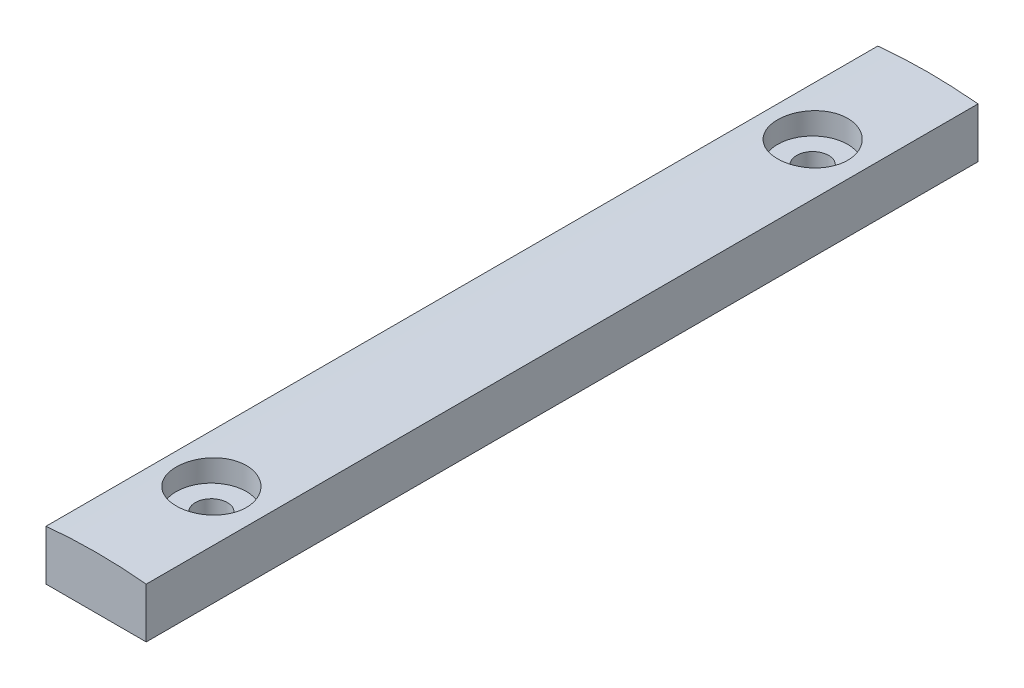
ISO-10303-21;
HEADER;
FILE_DESCRIPTION(('STEP AP214'),'2;1');
FILE_NAME('part.step','',(''),(''),'','','');
FILE_SCHEMA(('AUTOMOTIVE_DESIGN { 1 0 10303 214 1 1 1 1 }'));
ENDSEC;
DATA;
#1=APPLICATION_CONTEXT('core data for automotive mechanical design processes');
#2=APPLICATION_PROTOCOL_DEFINITION('international standard','automotive_design',2000,#1);
#3=PRODUCT_CONTEXT('',#1,'mechanical');
#4=PRODUCT('Part','Part','',(#3));
#5=PRODUCT_RELATED_PRODUCT_CATEGORY('part','',(#4));
#6=PRODUCT_DEFINITION_FORMATION('','',#4);
#7=PRODUCT_DEFINITION_CONTEXT('part definition',#1,'design');
#8=PRODUCT_DEFINITION('design','',#6,#7);
#9=PRODUCT_DEFINITION_SHAPE('','',#8);
#10=(LENGTH_UNIT() NAMED_UNIT(*) SI_UNIT(.MILLI.,.METRE.));
#11=(NAMED_UNIT(*) PLANE_ANGLE_UNIT() SI_UNIT($,.RADIAN.));
#12=(NAMED_UNIT(*) SI_UNIT($,.STERADIAN.) SOLID_ANGLE_UNIT());
#13=UNCERTAINTY_MEASURE_WITH_UNIT(LENGTH_MEASURE(1.E-05),#10,'distance_accuracy_value','');
#14=(GEOMETRIC_REPRESENTATION_CONTEXT(3) GLOBAL_UNCERTAINTY_ASSIGNED_CONTEXT((#13)) GLOBAL_UNIT_ASSIGNED_CONTEXT((#10,
#11,#12)) REPRESENTATION_CONTEXT('',''));
#15=CARTESIAN_POINT('',(0.,0.,0.));
#16=DIRECTION('',(0.,0.,1.));
#17=DIRECTION('',(1.,0.,0.));
#18=AXIS2_PLACEMENT_3D('',#15,#16,#17);
#19=CARTESIAN_POINT('',(5.,10.,11.5));
#20=DIRECTION('',(0.,-1.,0.));
#21=DIRECTION('',(1.,0.,0.));
#22=AXIS2_PLACEMENT_3D('',#19,#20,#21);
#23=CYLINDRICAL_SURFACE('',#22,1.6);
#24=CARTESIAN_POINT('',(5.,0.,11.5));
#25=DIRECTION('',(0.,1.,0.));
#26=DIRECTION('',(0.,0.,1.));
#27=AXIS2_PLACEMENT_3D('',#24,#25,#26);
#28=CIRCLE('',#27,1.6);
#29=CARTESIAN_POINT('',(5.,0.,13.1));
#30=VERTEX_POINT('',#29);
#31=EDGE_CURVE('E125',#30,#30,#28,.T.);
#32=ORIENTED_EDGE('',*,*,#31,.F.);
#33=EDGE_LOOP('',(#32));
#34=FACE_BOUND('',#33,.T.);
#35=CARTESIAN_POINT('',(5.,3.,11.5));
#36=DIRECTION('',(0.,1.,0.));
#37=DIRECTION('',(-1.,0.,0.));
#38=AXIS2_PLACEMENT_3D('',#35,#36,#37);
#39=CIRCLE('',#38,1.6);
#40=CARTESIAN_POINT('',(3.4,3.,11.5));
#41=VERTEX_POINT('',#40);
#42=EDGE_CURVE('E173',#41,#41,#39,.F.);
#43=ORIENTED_EDGE('',*,*,#42,.F.);
#44=EDGE_LOOP('',(#43));
#45=FACE_BOUND('',#44,.T.);
#46=ADVANCED_FACE('F35',(#34,#45),#23,.F.);
#47=CARTESIAN_POINT('',(5.,-44.749371855331,83.));
#48=DIRECTION('',(0.,0.,-1.));
#49=DIRECTION('',(-1.,0.,0.));
#50=AXIS2_PLACEMENT_3D('',#47,#48,#49);
#51=CYLINDRICAL_SURFACE('',#50,50.);
#52=CARTESIAN_POINT('',(8.5,5.12797771338606,11.5));
#53=CARTESIAN_POINT('',(8.49999138017212,5.12797934916533,11.6963379671098));
#54=CARTESIAN_POINT('',(8.48342363444229,5.12914948656254,11.8928121645192));
#55=CARTESIAN_POINT('',(8.41757146491605,5.13370395775746,12.2803318097353));
#56=CARTESIAN_POINT('',(8.36824929065263,5.13709084636274,12.47137072797));
#57=CARTESIAN_POINT('',(8.23831511853374,5.14569332631141,12.8423506761975));
#58=CARTESIAN_POINT('',(8.15772003692143,5.15090792885456,13.0222976452044));
#59=CARTESIAN_POINT('',(7.96755614329887,5.16257702882179,13.3660635685417));
#60=CARTESIAN_POINT('',(7.85799382142465,5.16903124842007,13.5298861242927));
#61=CARTESIAN_POINT('',(7.61278459079358,5.18246581908672,13.8371018148218));
#62=CARTESIAN_POINT('',(7.47709528904635,5.1894470138641,13.98046107894));
#63=CARTESIAN_POINT('',(7.18357227450858,5.20314112110373,14.2423904278678));
#64=CARTESIAN_POINT('',(7.02573762437835,5.20985402219453,14.3609594628592));
#65=CARTESIAN_POINT('',(6.69220885113593,5.22226273550741,14.5700500669501));
#66=CARTESIAN_POINT('',(6.51649680851785,5.22795751112782,14.6605431187049));
#67=CARTESIAN_POINT('',(6.15232650850268,5.2376793450455,14.8107304887511));
#68=CARTESIAN_POINT('',(5.96386841587429,5.24170642489635,14.8704252050878));
#69=CARTESIAN_POINT('',(5.57988621085092,5.24763326350508,14.9572260571529));
#70=CARTESIAN_POINT('',(5.38437430084774,5.24953652973262,14.9843859295158));
#71=CARTESIAN_POINT('',(4.99155802993902,5.25101313152392,15.0055121300194));
#72=CARTESIAN_POINT('',(4.7942536935751,5.25058649894041,14.9994789119526));
#73=CARTESIAN_POINT('',(4.40381741684496,5.24745428934823,14.9544343871595));
#74=CARTESIAN_POINT('',(4.21067877205873,5.24475270636541,14.9154808766457));
#75=CARTESIAN_POINT('',(3.83368812729361,5.23737925017503,14.8057912630361));
#76=CARTESIAN_POINT('',(3.64983619331988,5.23270736296576,14.7350549340797));
#77=CARTESIAN_POINT('',(3.29645283731996,5.22191229851404,14.5637425182885));
#78=CARTESIAN_POINT('',(3.12693410414769,5.21578785323077,14.4631403400151));
#79=CARTESIAN_POINT('',(2.80716770414176,5.20277660598381,14.2349709167681));
#80=CARTESIAN_POINT('',(2.65692031121521,5.19588979318705,14.1074032885978));
#81=CARTESIAN_POINT('',(2.37962403535864,5.18211107797035,13.828597942247));
#82=CARTESIAN_POINT('',(2.25262560224093,5.17521919631723,13.67731004088));
#83=CARTESIAN_POINT('',(2.02582149579202,5.16222207836329,13.3555341651356));
#84=CARTESIAN_POINT('',(1.92601583649572,5.15611684246847,13.1850461808486));
#85=CARTESIAN_POINT('',(1.7564334382666,5.14538269727309,12.8296764986289));
#86=CARTESIAN_POINT('',(1.68665898547055,5.14075390037395,12.6447937061507));
#87=CARTESIAN_POINT('',(1.57915529322709,5.13349844866595,12.2658979673137));
#88=CARTESIAN_POINT('',(1.54142558020113,5.1308717642686,12.0718851559291));
#89=CARTESIAN_POINT('',(1.49914555962304,5.12792233501157,11.6806772089123));
#90=CARTESIAN_POINT('',(1.49452505052844,5.12759471546845,11.4834896955117));
#91=CARTESIAN_POINT('',(1.51841102233662,5.12926762056341,11.0911426069196));
#92=CARTESIAN_POINT('',(1.5469172863173,5.13126812995633,10.8959830184573));
#93=CARTESIAN_POINT('',(1.63618923242063,5.13736741388135,10.5134311453508));
#94=CARTESIAN_POINT('',(1.69692244243091,5.14146407616589,10.3260312465237));
#95=CARTESIAN_POINT('',(1.84889135960223,5.15129225486289,9.96408305072061));
#96=CARTESIAN_POINT('',(1.94012741351508,5.15702378986021,9.78953489986899));
#97=CARTESIAN_POINT('',(2.15069098363804,5.16948768409711,9.4579229093695));
#98=CARTESIAN_POINT('',(2.27006545443855,5.17622170919611,9.30088894800126));
#99=CARTESIAN_POINT('',(2.5334490895883,5.1899260031762,9.00906426056042));
#100=CARTESIAN_POINT('',(2.6774585546516,5.19689627494027,8.87427380604899));
#101=CARTESIAN_POINT('',(2.98632682138749,5.21030199308096,8.63052439152335));
#102=CARTESIAN_POINT('',(3.15122156798533,5.21673648492565,8.5216109196464));
#103=CARTESIAN_POINT('',(3.49699943833292,5.22833190696925,8.33301866210167));
#104=CARTESIAN_POINT('',(3.67788244321613,5.23349284663543,8.25333965910955));
#105=CARTESIAN_POINT('',(4.05033638403842,5.24195516428597,8.12555693316016));
#106=CARTESIAN_POINT('',(4.24189747753082,5.24525822459506,8.07742463785629));
#107=CARTESIAN_POINT('',(4.63040610456045,5.24963936653347,8.01400815981689));
#108=CARTESIAN_POINT('',(4.82735356907498,5.2507174766605,7.99872355635987));
#109=CARTESIAN_POINT('',(5.22059473099542,5.25052731831249,8.00144065025518));
#110=CARTESIAN_POINT('',(5.41688892594794,5.2492640608693,8.01937125983946));
#111=CARTESIAN_POINT('',(5.80367173879962,5.24454310934865,8.08786212118436));
#112=CARTESIAN_POINT('',(5.99416034713989,5.24108541165825,8.13842242666665));
#113=CARTESIAN_POINT('',(6.3639332426134,5.23236398466687,8.27072067745535));
#114=CARTESIAN_POINT('',(6.54321776298884,5.22710029297716,8.35245797347991));
#115=CARTESIAN_POINT('',(6.88552933016287,5.21535717679981,8.54478089968499));
#116=CARTESIAN_POINT('',(7.04855674432338,5.20887777979302,8.65536587779001));
#117=CARTESIAN_POINT('',(7.35408850759354,5.19541507530449,8.90251000111994));
#118=CARTESIAN_POINT('',(7.49655077663273,5.18843077730353,9.03912111262916));
#119=CARTESIAN_POINT('',(7.75657317372269,5.17475363677163,9.33435873053255));
#120=CARTESIAN_POINT('',(7.87412722064897,5.16806086573056,9.49299059749145));
#121=CARTESIAN_POINT('',(8.0811064331264,5.15571388640329,9.82798884586409));
#122=CARTESIAN_POINT('',(8.17049072297035,5.15006119222103,10.0043805127251));
#123=CARTESIAN_POINT('',(8.31826310442802,5.14045340664035,10.3695818033303));
#124=CARTESIAN_POINT('',(8.37668728185529,5.13649633992396,10.5583766805152));
#125=CARTESIAN_POINT('',(8.44579537587166,5.13175859222299,10.8735945556911));
#126=CARTESIAN_POINT('',(8.46609558617902,5.13034715753171,10.9979831481877));
#127=CARTESIAN_POINT('',(8.49320065012735,5.12845619442863,11.2482291527003));
#128=CARTESIAN_POINT('',(8.50000552797902,5.12797666434499,11.3740865620808));
#129=CARTESIAN_POINT('',(8.5,5.12797771338606,11.5));
#130=B_SPLINE_CURVE_WITH_KNOTS('',3,(#52,#53,#54,#55,#56,#57,#58,#59,#60,#61,#62,#63,#64,#65,
#66,#67,#68,#69,#70,#71,#72,#73,#74,#75,#76,#77,#78,#79,#80,#81,#82,#83,#84,#85,#86,#87,#88,#89,
#90,#91,#92,#93,#94,#95,#96,#97,#98,#99,#100,#101,#102,#103,#104,#105,#106,#107,#108,#109,#110,
#111,#112,#113,#114,#115,#116,#117,#118,#119,#120,#121,#122,#123,#124,#125,#126,#127,#128,#129),
.UNSPECIFIED.,.T.,.F.,(4,2,2,2,2,2,2,2,2,2,2,2,2,2,2,2,2,2,2,2,2,2,2,2,2,2,2,2,2,2,2,2,2,2,2,2,
2,2,4),(0.,0.588554216273836,1.17778793900944,1.76670337484306,2.35548697529842,
2.94523409691631,3.53500618812313,4.12537537631882,4.71573693424673,5.30512206277371,
5.89449913366063,6.48284361445073,7.07119227630192,7.66005645219801,8.24892899680193,
8.83906461661277,9.42920054100749,10.0193813817765,10.6095535003073,11.1984739038846,
11.7873904510905,12.3757147252277,12.9640456875756,13.5533654363642,14.1426923793652,
14.7330477368474,15.3233987056342,15.9132142427062,16.5030222252272,17.0915693487741,
17.6801174413102,18.2686532776045,18.8571758117363,19.4468860017003,20.0367399987803,
20.6274460037431,21.2174619836192,21.5949081740441,21.9723536873278),.UNSPECIFIED.);
#131=CARTESIAN_POINT('',(8.5,5.12797771338606,11.5));
#132=VERTEX_POINT('',#131);
#133=EDGE_CURVE('E39',#132,#132,#130,.T.);
#134=ORIENTED_EDGE('',*,*,#133,.T.);
#135=EDGE_LOOP('',(#134));
#136=FACE_BOUND('',#135,.T.);
#137=CARTESIAN_POINT('',(5.,-44.749371855331,0.));
#138=DIRECTION('',(0.,0.,1.));
#139=DIRECTION('',(-1.,0.,0.));
#140=AXIS2_PLACEMENT_3D('',#137,#138,#139);
#141=CIRCLE('',#140,50.);
#142=CARTESIAN_POINT('',(10.,5.,0.));
#143=VERTEX_POINT('',#142);
#144=CARTESIAN_POINT('',(0.,5.,0.));
#145=VERTEX_POINT('',#144);
#146=EDGE_CURVE('E81',#143,#145,#141,.T.);
#147=ORIENTED_EDGE('',*,*,#146,.T.);
#148=DIRECTION('',(0.,0.,-1.));
#149=VECTOR('',#148,1.);
#150=CARTESIAN_POINT('',(0.,5.,83.));
#151=LINE('',#150,#149);
#152=CARTESIAN_POINT('',(0.,5.,83.));
#153=VERTEX_POINT('',#152);
#154=EDGE_CURVE('E102',#153,#145,#151,.T.);
#155=ORIENTED_EDGE('',*,*,#154,.F.);
#156=CARTESIAN_POINT('',(5.,-44.749371855331,83.));
#157=DIRECTION('',(0.,0.,1.));
#158=DIRECTION('',(-1.,0.,0.));
#159=AXIS2_PLACEMENT_3D('',#156,#157,#158);
#160=CIRCLE('',#159,50.);
#161=CARTESIAN_POINT('',(10.,5.,83.));
#162=VERTEX_POINT('',#161);
#163=EDGE_CURVE('E58',#162,#153,#160,.T.);
#164=ORIENTED_EDGE('',*,*,#163,.F.);
#165=DIRECTION('',(0.,0.,-1.));
#166=VECTOR('',#165,1.);
#167=CARTESIAN_POINT('',(10.,5.,83.));
#168=LINE('',#167,#166);
#169=EDGE_CURVE('E98',#162,#143,#168,.T.);
#170=ORIENTED_EDGE('',*,*,#169,.T.);
#171=EDGE_LOOP('',(#147,#155,#164,#170));
#172=FACE_BOUND('',#171,.T.);
#173=CARTESIAN_POINT('',(8.5,5.12797771338606,71.5));
#174=CARTESIAN_POINT('',(8.49999138017212,5.12797934916533,71.3036620328902));
#175=CARTESIAN_POINT('',(8.48342363444229,5.12914948656254,71.1071878354808));
#176=CARTESIAN_POINT('',(8.41757146491605,5.13370395775746,70.7196681902647));
#177=CARTESIAN_POINT('',(8.36824929065263,5.13709084636274,70.52862927203));
#178=CARTESIAN_POINT('',(8.23831511853374,5.14569332631141,70.1576493238025));
#179=CARTESIAN_POINT('',(8.15772003692143,5.15090792885456,69.9777023547956));
#180=CARTESIAN_POINT('',(7.96755614329887,5.16257702882179,69.6339364314583));
#181=CARTESIAN_POINT('',(7.85799382142466,5.16903124842007,69.4701138757073));
#182=CARTESIAN_POINT('',(7.61278459079359,5.18246581908672,69.1628981851782));
#183=CARTESIAN_POINT('',(7.47709528904635,5.1894470138641,69.01953892106));
#184=CARTESIAN_POINT('',(7.18357227450859,5.20314112110374,68.7576095721322));
#185=CARTESIAN_POINT('',(7.02573762437836,5.20985402219453,68.6390405371408));
#186=CARTESIAN_POINT('',(6.69220885113594,5.22226273550741,68.4299499330499));
#187=CARTESIAN_POINT('',(6.51649680851786,5.22795751112782,68.3394568812951));
#188=CARTESIAN_POINT('',(6.1523265085027,5.2376793450455,68.1892695112489));
#189=CARTESIAN_POINT('',(5.9638684158743,5.24170642489635,68.1295747949122));
#190=CARTESIAN_POINT('',(5.57988621085093,5.24763326350508,68.0427739428471));
#191=CARTESIAN_POINT('',(5.38437430084775,5.24953652973263,68.0156140704842));
#192=CARTESIAN_POINT('',(4.99155802993903,5.25101313152392,67.9944878699806));
#193=CARTESIAN_POINT('',(4.79425369357511,5.25058649894042,68.0005210880474));
#194=CARTESIAN_POINT('',(4.40381741684497,5.24745428934823,68.0455656128405));
#195=CARTESIAN_POINT('',(4.21067877205873,5.24475270636541,68.0845191233543));
#196=CARTESIAN_POINT('',(3.83368812729361,5.23737925017503,68.1942087369639));
#197=CARTESIAN_POINT('',(3.64983619331989,5.23270736296576,68.2649450659203));
#198=CARTESIAN_POINT('',(3.29645283731997,5.22191229851405,68.4362574817115));
#199=CARTESIAN_POINT('',(3.12693410414771,5.21578785323077,68.5368596599849));
#200=CARTESIAN_POINT('',(2.80716770414177,5.20277660598381,68.7650290832319));
#201=CARTESIAN_POINT('',(2.65692031121522,5.19588979318705,68.8925967114022));
#202=CARTESIAN_POINT('',(2.37962403535865,5.18211107797035,69.171402057753));
#203=CARTESIAN_POINT('',(2.25262560224094,5.17521919631723,69.32268995912));
#204=CARTESIAN_POINT('',(2.02582149579203,5.16222207836329,69.6444658348644));
#205=CARTESIAN_POINT('',(1.92601583649573,5.15611684246847,69.8149538191514));
#206=CARTESIAN_POINT('',(1.75643343826661,5.14538269727309,70.1703235013711));
#207=CARTESIAN_POINT('',(1.68665898547055,5.14075390037394,70.3552062938493));
#208=CARTESIAN_POINT('',(1.57915529322709,5.13349844866595,70.7341020326863));
#209=CARTESIAN_POINT('',(1.54142558020113,5.13087176426861,70.9281148440709));
#210=CARTESIAN_POINT('',(1.49914555962304,5.12792233501158,71.3193227910877));
#211=CARTESIAN_POINT('',(1.49452505052843,5.12759471546846,71.5165103044883));
#212=CARTESIAN_POINT('',(1.51841102233662,5.12926762056341,71.9088573930804));
#213=CARTESIAN_POINT('',(1.5469172863173,5.13126812995632,72.1040169815427));
#214=CARTESIAN_POINT('',(1.63618923242063,5.13736741388134,72.4865688546492));
#215=CARTESIAN_POINT('',(1.69692244243091,5.1414640761659,72.6739687534763));
#216=CARTESIAN_POINT('',(1.84889135960222,5.15129225486289,73.0359169492794));
#217=CARTESIAN_POINT('',(1.94012741351507,5.15702378986021,73.210465100131));
#218=CARTESIAN_POINT('',(2.15069098363803,5.16948768409711,73.5420770906305));
#219=CARTESIAN_POINT('',(2.27006545443853,5.17622170919611,73.6991110519987));
#220=CARTESIAN_POINT('',(2.53344908958828,5.18992600317619,73.9909357394396));
#221=CARTESIAN_POINT('',(2.67745855465159,5.19689627494025,74.125726193951));
#222=CARTESIAN_POINT('',(2.98632682138747,5.21030199308095,74.3694756084766));
#223=CARTESIAN_POINT('',(3.15122156798532,5.21673648492565,74.4783890803536));
#224=CARTESIAN_POINT('',(3.49699943833291,5.22833190696925,74.6669813378983));
#225=CARTESIAN_POINT('',(3.67788244321612,5.23349284663543,74.7466603408905));
#226=CARTESIAN_POINT('',(4.0503363840384,5.24195516428597,74.8744430668398));
#227=CARTESIAN_POINT('',(4.2418974775308,5.24525822459506,74.9225753621437));
#228=CARTESIAN_POINT('',(4.63040610456044,5.24963936653347,74.9859918401831));
#229=CARTESIAN_POINT('',(4.82735356907497,5.2507174766605,75.0012764436401));
#230=CARTESIAN_POINT('',(5.22059473099541,5.25052731831249,74.9985593497448));
#231=CARTESIAN_POINT('',(5.41688892594794,5.2492640608693,74.9806287401605));
#232=CARTESIAN_POINT('',(5.80367173879962,5.24454310934865,74.9121378788156));
#233=CARTESIAN_POINT('',(5.99416034713989,5.24108541165825,74.8615775733334));
#234=CARTESIAN_POINT('',(6.36393324261339,5.23236398466687,74.7292793225447));
#235=CARTESIAN_POINT('',(6.54321776298883,5.22710029297716,74.6475420265201));
#236=CARTESIAN_POINT('',(6.88552933016287,5.21535717679982,74.455219100315));
#237=CARTESIAN_POINT('',(7.04855674432338,5.20887777979302,74.34463412221));
#238=CARTESIAN_POINT('',(7.35408850759353,5.19541507530449,74.0974899988801));
#239=CARTESIAN_POINT('',(7.49655077663273,5.18843077730353,73.9608788873709));
#240=CARTESIAN_POINT('',(7.75657317372268,5.17475363677163,73.6656412694675));
#241=CARTESIAN_POINT('',(7.87412722064897,5.16806086573056,73.5070094025086));
#242=CARTESIAN_POINT('',(8.08110643312639,5.15571388640328,73.1720111541359));
#243=CARTESIAN_POINT('',(8.17049072297034,5.15006119222102,72.9956194872749));
#244=CARTESIAN_POINT('',(8.31826310442802,5.14045340664035,72.6304181966697));
#245=CARTESIAN_POINT('',(8.37668728185529,5.13649633992395,72.4416233194848));
#246=CARTESIAN_POINT('',(8.44579537587166,5.13175859222299,72.126405444309));
#247=CARTESIAN_POINT('',(8.46609558617902,5.13034715753171,72.0020168518123));
#248=CARTESIAN_POINT('',(8.49320065012734,5.12845619442863,71.7517708472997));
#249=CARTESIAN_POINT('',(8.50000552797902,5.12797666434499,71.6259134379192));
#250=CARTESIAN_POINT('',(8.5,5.12797771338606,71.5));
#251=B_SPLINE_CURVE_WITH_KNOTS('',3,(#173,#174,#175,#176,#177,#178,#179,#180,#181,#182,#183,
#184,#185,#186,#187,#188,#189,#190,#191,#192,#193,#194,#195,#196,#197,#198,#199,#200,#201,#202,
#203,#204,#205,#206,#207,#208,#209,#210,#211,#212,#213,#214,#215,#216,#217,#218,#219,#220,#221,
#222,#223,#224,#225,#226,#227,#228,#229,#230,#231,#232,#233,#234,#235,#236,#237,#238,#239,#240,
#241,#242,#243,#244,#245,#246,#247,#248,#249,#250),.UNSPECIFIED.,.T.,.F.,(4,2,2,2,2,2,2,2,2,2,2,
2,2,2,2,2,2,2,2,2,2,2,2,2,2,2,2,2,2,2,2,2,2,2,2,2,2,2,4),(0.,0.588554216273836,1.17778793900943,
1.76670337484305,2.35548697529841,2.9452340969163,3.53500618812312,4.12537537631881,
4.71573693424672,5.3051220627737,5.89449913366062,6.48284361445072,7.07119227630191,
7.660056452198,8.24892899680193,8.83906461661276,9.42920054100748,10.0193813817765,
10.6095535003073,11.1984739038846,11.7873904510905,12.3757147252276,12.9640456875756,
13.5533654363641,14.1426923793651,14.7330477368473,15.3233987056342,15.9132142427062,
16.5030222252272,17.0915693487741,17.6801174413102,18.2686532776044,18.8571758117363,
19.4468860017003,20.0367399987803,20.6274460037431,21.2174619836192,21.5949081740441,
21.9723536873279),.UNSPECIFIED.);
#252=CARTESIAN_POINT('',(8.5,5.12797771338606,71.5));
#253=VERTEX_POINT('',#252);
#254=EDGE_CURVE('E118',#253,#253,#251,.T.);
#255=ORIENTED_EDGE('',*,*,#254,.F.);
#256=EDGE_LOOP('',(#255));
#257=FACE_BOUND('',#256,.T.);
#258=ADVANCED_FACE('F126',(#136,#172,#257),#51,.T.);
#259=CARTESIAN_POINT('',(5.,10.,71.5));
#260=DIRECTION('',(0.,-1.,0.));
#261=DIRECTION('',(1.,0.,0.));
#262=AXIS2_PLACEMENT_3D('',#259,#260,#261);
#263=CYLINDRICAL_SURFACE('',#262,1.6);
#264=CARTESIAN_POINT('',(5.,0.,71.5));
#265=DIRECTION('',(0.,1.,0.));
#266=DIRECTION('',(0.,0.,1.));
#267=AXIS2_PLACEMENT_3D('',#264,#265,#266);
#268=CIRCLE('',#267,1.6);
#269=CARTESIAN_POINT('',(5.,0.,73.1));
#270=VERTEX_POINT('',#269);
#271=EDGE_CURVE('E109',#270,#270,#268,.F.);
#272=ORIENTED_EDGE('',*,*,#271,.T.);
#273=EDGE_LOOP('',(#272));
#274=FACE_BOUND('',#273,.T.);
#275=CARTESIAN_POINT('',(5.,3.,71.5));
#276=DIRECTION('',(0.,1.,0.));
#277=DIRECTION('',(-1.,0.,0.));
#278=AXIS2_PLACEMENT_3D('',#275,#276,#277);
#279=CIRCLE('',#278,1.6);
#280=CARTESIAN_POINT('',(3.4,3.,71.5));
#281=VERTEX_POINT('',#280);
#282=EDGE_CURVE('E115',#281,#281,#279,.T.);
#283=ORIENTED_EDGE('',*,*,#282,.T.);
#284=EDGE_LOOP('',(#283));
#285=FACE_BOUND('',#284,.T.);
#286=ADVANCED_FACE('F139',(#274,#285),#263,.F.);
#287=CARTESIAN_POINT('',(0.,0.,83.));
#288=DIRECTION('',(1.,0.,0.));
#289=DIRECTION('',(0.,0.,-1.));
#290=AXIS2_PLACEMENT_3D('',#287,#288,#289);
#291=PLANE('',#290);
#292=DIRECTION('',(0.,-1.,0.));
#293=VECTOR('',#292,1.);
#294=CARTESIAN_POINT('',(0.,0.,0.));
#295=LINE('',#294,#293);
#296=CARTESIAN_POINT('',(0.,0.,0.));
#297=VERTEX_POINT('',#296);
#298=EDGE_CURVE('E106',#145,#297,#295,.T.);
#299=ORIENTED_EDGE('',*,*,#298,.T.);
#300=DIRECTION('',(0.,0.,-1.));
#301=VECTOR('',#300,1.);
#302=CARTESIAN_POINT('',(0.,0.,83.));
#303=LINE('',#302,#301);
#304=CARTESIAN_POINT('',(0.,0.,83.));
#305=VERTEX_POINT('',#304);
#306=EDGE_CURVE('E11',#305,#297,#303,.T.);
#307=ORIENTED_EDGE('',*,*,#306,.F.);
#308=DIRECTION('',(0.,-1.,0.));
#309=VECTOR('',#308,1.);
#310=CARTESIAN_POINT('',(0.,0.,83.));
#311=LINE('',#310,#309);
#312=EDGE_CURVE('E93',#153,#305,#311,.T.);
#313=ORIENTED_EDGE('',*,*,#312,.F.);
#314=ORIENTED_EDGE('',*,*,#154,.T.);
#315=EDGE_LOOP('',(#299,#307,#313,#314));
#316=FACE_BOUND('',#315,.T.);
#317=ADVANCED_FACE('F37',(#316),#291,.F.);
#318=CARTESIAN_POINT('',(0.,0.,83.));
#319=DIRECTION('',(0.,1.,0.));
#320=DIRECTION('',(0.,0.,1.));
#321=AXIS2_PLACEMENT_3D('',#318,#319,#320);
#322=PLANE('',#321);
#323=ORIENTED_EDGE('',*,*,#31,.T.);
#324=EDGE_LOOP('',(#323));
#325=FACE_BOUND('',#324,.T.);
#326=ORIENTED_EDGE('',*,*,#271,.F.);
#327=EDGE_LOOP('',(#326));
#328=FACE_BOUND('',#327,.T.);
#329=DIRECTION('',(1.,0.,0.));
#330=VECTOR('',#329,1.);
#331=CARTESIAN_POINT('',(0.,0.,0.));
#332=LINE('',#331,#330);
#333=CARTESIAN_POINT('',(10.,0.,0.));
#334=VERTEX_POINT('',#333);
#335=EDGE_CURVE('E97',#297,#334,#332,.T.);
#336=ORIENTED_EDGE('',*,*,#335,.T.);
#337=DIRECTION('',(0.,0.,-1.));
#338=VECTOR('',#337,1.);
#339=CARTESIAN_POINT('',(10.,0.,83.));
#340=LINE('',#339,#338);
#341=CARTESIAN_POINT('',(10.,0.,83.));
#342=VERTEX_POINT('',#341);
#343=EDGE_CURVE('E49',#342,#334,#340,.T.);
#344=ORIENTED_EDGE('',*,*,#343,.F.);
#345=DIRECTION('',(1.,0.,0.));
#346=VECTOR('',#345,1.);
#347=CARTESIAN_POINT('',(0.,0.,83.));
#348=LINE('',#347,#346);
#349=EDGE_CURVE('E88',#305,#342,#348,.T.);
#350=ORIENTED_EDGE('',*,*,#349,.F.);
#351=ORIENTED_EDGE('',*,*,#306,.T.);
#352=EDGE_LOOP('',(#336,#344,#350,#351));
#353=FACE_BOUND('',#352,.T.);
#354=ADVANCED_FACE('F96',(#325,#328,#353),#322,.F.);
#355=CARTESIAN_POINT('',(10.,0.,83.));
#356=DIRECTION('',(-1.,0.,0.));
#357=DIRECTION('',(0.,0.,1.));
#358=AXIS2_PLACEMENT_3D('',#355,#356,#357);
#359=PLANE('',#358);
#360=DIRECTION('',(0.,1.,0.));
#361=VECTOR('',#360,1.);
#362=CARTESIAN_POINT('',(10.,0.,0.));
#363=LINE('',#362,#361);
#364=EDGE_CURVE('E75',#334,#143,#363,.T.);
#365=ORIENTED_EDGE('',*,*,#364,.T.);
#366=ORIENTED_EDGE('',*,*,#169,.F.);
#367=DIRECTION('',(0.,1.,0.));
#368=VECTOR('',#367,1.);
#369=CARTESIAN_POINT('',(10.,0.,83.));
#370=LINE('',#369,#368);
#371=EDGE_CURVE('E91',#342,#162,#370,.T.);
#372=ORIENTED_EDGE('',*,*,#371,.F.);
#373=ORIENTED_EDGE('',*,*,#343,.T.);
#374=EDGE_LOOP('',(#365,#366,#372,#373));
#375=FACE_BOUND('',#374,.T.);
#376=ADVANCED_FACE('F100',(#375),#359,.F.);
#377=CARTESIAN_POINT('',(5.,-44.749371855331,83.));
#378=DIRECTION('',(0.,0.,-1.));
#379=DIRECTION('',(-1.,0.,0.));
#380=AXIS2_PLACEMENT_3D('',#377,#378,#379);
#381=PLANE('',#380);
#382=ORIENTED_EDGE('',*,*,#312,.T.);
#383=ORIENTED_EDGE('',*,*,#349,.T.);
#384=ORIENTED_EDGE('',*,*,#371,.T.);
#385=ORIENTED_EDGE('',*,*,#163,.T.);
#386=EDGE_LOOP('',(#382,#383,#384,#385));
#387=FACE_BOUND('',#386,.T.);
#388=ADVANCED_FACE('F89',(#387),#381,.F.);
#389=CARTESIAN_POINT('',(5.,-44.749371855331,0.));
#390=DIRECTION('',(0.,0.,-1.));
#391=DIRECTION('',(-1.,0.,0.));
#392=AXIS2_PLACEMENT_3D('',#389,#390,#391);
#393=PLANE('',#392);
#394=ORIENTED_EDGE('',*,*,#298,.F.);
#395=ORIENTED_EDGE('',*,*,#146,.F.);
#396=ORIENTED_EDGE('',*,*,#364,.F.);
#397=ORIENTED_EDGE('',*,*,#335,.F.);
#398=EDGE_LOOP('',(#394,#395,#396,#397));
#399=FACE_BOUND('',#398,.T.);
#400=ADVANCED_FACE('F136',(#399),#393,.T.);
#401=CARTESIAN_POINT('',(5.,7.,71.5));
#402=DIRECTION('',(0.,-1.,0.));
#403=DIRECTION('',(1.,0.,0.));
#404=AXIS2_PLACEMENT_3D('',#401,#402,#403);
#405=CYLINDRICAL_SURFACE('',#404,3.5);
#406=CARTESIAN_POINT('',(5.,3.,71.5));
#407=DIRECTION('',(0.,1.,0.));
#408=DIRECTION('',(-1.,0.,0.));
#409=AXIS2_PLACEMENT_3D('',#406,#407,#408);
#410=CIRCLE('',#409,3.5);
#411=CARTESIAN_POINT('',(1.5,3.,71.5));
#412=VERTEX_POINT('',#411);
#413=EDGE_CURVE('E119',#412,#412,#410,.T.);
#414=ORIENTED_EDGE('',*,*,#413,.F.);
#415=EDGE_LOOP('',(#414));
#416=FACE_BOUND('',#415,.T.);
#417=ORIENTED_EDGE('',*,*,#254,.T.);
#418=EDGE_LOOP('',(#417));
#419=FACE_BOUND('',#418,.T.);
#420=ADVANCED_FACE('F130',(#416,#419),#405,.F.);
#421=CARTESIAN_POINT('',(5.,3.,71.5));
#422=DIRECTION('',(0.,1.,0.));
#423=DIRECTION('',(-1.,0.,0.));
#424=AXIS2_PLACEMENT_3D('',#421,#422,#423);
#425=PLANE('',#424);
#426=ORIENTED_EDGE('',*,*,#282,.F.);
#427=EDGE_LOOP('',(#426));
#428=FACE_BOUND('',#427,.T.);
#429=ORIENTED_EDGE('',*,*,#413,.T.);
#430=EDGE_LOOP('',(#429));
#431=FACE_BOUND('',#430,.T.);
#432=ADVANCED_FACE('F135',(#428,#431),#425,.T.);
#433=CARTESIAN_POINT('',(5.,7.,11.5));
#434=DIRECTION('',(0.,-1.,0.));
#435=DIRECTION('',(1.,0.,0.));
#436=AXIS2_PLACEMENT_3D('',#433,#434,#435);
#437=CYLINDRICAL_SURFACE('',#436,3.5);
#438=CARTESIAN_POINT('',(5.,3.,11.5));
#439=DIRECTION('',(0.,-1.,0.));
#440=DIRECTION('',(-1.,0.,0.));
#441=AXIS2_PLACEMENT_3D('',#438,#439,#440);
#442=CIRCLE('',#441,3.5);
#443=CARTESIAN_POINT('',(1.5,3.,11.5));
#444=VERTEX_POINT('',#443);
#445=EDGE_CURVE('E170',#444,#444,#442,.T.);
#446=ORIENTED_EDGE('',*,*,#445,.T.);
#447=EDGE_LOOP('',(#446));
#448=FACE_BOUND('',#447,.T.);
#449=ORIENTED_EDGE('',*,*,#133,.F.);
#450=EDGE_LOOP('',(#449));
#451=FACE_BOUND('',#450,.T.);
#452=ADVANCED_FACE('F157',(#448,#451),#437,.F.);
#453=CARTESIAN_POINT('',(5.,3.,11.5));
#454=DIRECTION('',(0.,1.,0.));
#455=DIRECTION('',(-1.,0.,0.));
#456=AXIS2_PLACEMENT_3D('',#453,#454,#455);
#457=PLANE('',#456);
#458=ORIENTED_EDGE('',*,*,#445,.F.);
#459=EDGE_LOOP('',(#458));
#460=FACE_BOUND('',#459,.T.);
#461=ORIENTED_EDGE('',*,*,#42,.T.);
#462=EDGE_LOOP('',(#461));
#463=FACE_BOUND('',#462,.T.);
#464=ADVANCED_FACE('F161',(#460,#463),#457,.T.);
#465=CLOSED_SHELL('',(#46,#258,#286,#317,#354,#376,#388,#400,#420,#432,#452,#464));
#466=MANIFOLD_SOLID_BREP('B2',#465);
#467=ADVANCED_BREP_SHAPE_REPRESENTATION('',(#18,#466),#14);
#468=SHAPE_DEFINITION_REPRESENTATION(#9,#467);
ENDSEC;
END-ISO-10303-21;
